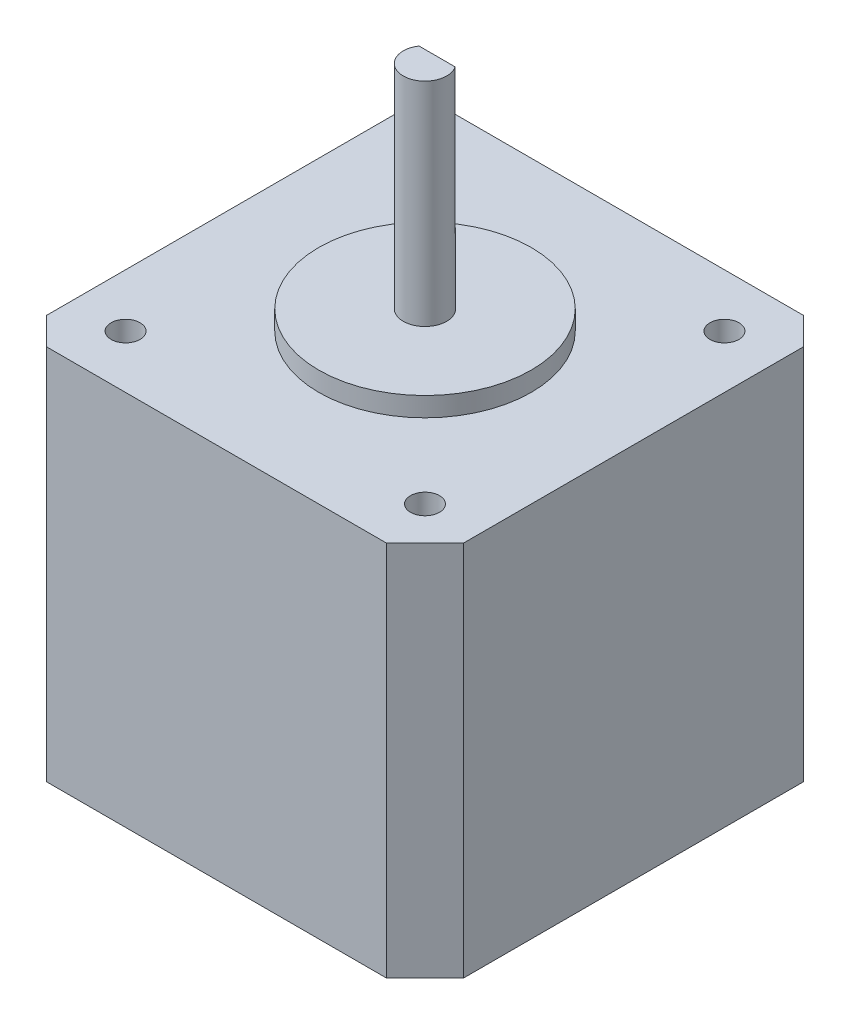
ISO-10303-21;
HEADER;
FILE_DESCRIPTION(('STEP AP214'),'2;1');
FILE_NAME('part.step','',(''),(''),'','','');
FILE_SCHEMA(('AUTOMOTIVE_DESIGN { 1 0 10303 214 1 1 1 1 }'));
ENDSEC;
DATA;
#1=APPLICATION_CONTEXT('core data for automotive mechanical design processes');
#2=APPLICATION_PROTOCOL_DEFINITION('international standard','automotive_design',2000,#1);
#3=PRODUCT_CONTEXT('',#1,'mechanical');
#4=PRODUCT('Part','Part','',(#3));
#5=PRODUCT_RELATED_PRODUCT_CATEGORY('part','',(#4));
#6=PRODUCT_DEFINITION_FORMATION('','',#4);
#7=PRODUCT_DEFINITION_CONTEXT('part definition',#1,'design');
#8=PRODUCT_DEFINITION('design','',#6,#7);
#9=PRODUCT_DEFINITION_SHAPE('','',#8);
#10=(LENGTH_UNIT() NAMED_UNIT(*) SI_UNIT(.MILLI.,.METRE.));
#11=(NAMED_UNIT(*) PLANE_ANGLE_UNIT() SI_UNIT($,.RADIAN.));
#12=(NAMED_UNIT(*) SI_UNIT($,.STERADIAN.) SOLID_ANGLE_UNIT());
#13=UNCERTAINTY_MEASURE_WITH_UNIT(LENGTH_MEASURE(1.E-05),#10,'distance_accuracy_value','');
#14=(GEOMETRIC_REPRESENTATION_CONTEXT(3) GLOBAL_UNCERTAINTY_ASSIGNED_CONTEXT((#13)) GLOBAL_UNIT_ASSIGNED_CONTEXT((#10,
#11,#12)) REPRESENTATION_CONTEXT('',''));
#15=CARTESIAN_POINT('',(0.,0.,0.));
#16=DIRECTION('',(0.,0.,1.));
#17=DIRECTION('',(1.,0.,0.));
#18=AXIS2_PLACEMENT_3D('',#15,#16,#17);
#19=CARTESIAN_POINT('',(-21.,39.,-18.1715728752538));
#20=DIRECTION('',(1.,0.,0.));
#21=DIRECTION('',(0.,0.,-1.));
#22=AXIS2_PLACEMENT_3D('',#19,#20,#21);
#23=PLANE('',#22);
#24=DIRECTION('',(0.,0.,1.));
#25=VECTOR('',#24,1.);
#26=CARTESIAN_POINT('',(-21.,0.,-18.1715728752538));
#27=LINE('',#26,#25);
#28=CARTESIAN_POINT('',(-21.,0.,-18.1715728752538));
#29=VERTEX_POINT('',#28);
#30=CARTESIAN_POINT('',(-21.,0.,18.1715728752538));
#31=VERTEX_POINT('',#30);
#32=EDGE_CURVE('E151',#29,#31,#27,.T.);
#33=ORIENTED_EDGE('',*,*,#32,.T.);
#34=DIRECTION('',(0.,-1.,0.));
#35=VECTOR('',#34,1.);
#36=CARTESIAN_POINT('',(-21.,39.,18.1715728752538));
#37=LINE('',#36,#35);
#38=CARTESIAN_POINT('',(-21.,39.,18.1715728752538));
#39=VERTEX_POINT('',#38);
#40=EDGE_CURVE('E11',#39,#31,#37,.T.);
#41=ORIENTED_EDGE('',*,*,#40,.F.);
#42=DIRECTION('',(0.,0.,1.));
#43=VECTOR('',#42,1.);
#44=CARTESIAN_POINT('',(-21.,39.,-18.1715728752538));
#45=LINE('',#44,#43);
#46=CARTESIAN_POINT('',(-21.,39.,-18.1715728752538));
#47=VERTEX_POINT('',#46);
#48=EDGE_CURVE('E170',#47,#39,#45,.T.);
#49=ORIENTED_EDGE('',*,*,#48,.F.);
#50=DIRECTION('',(0.,-1.,0.));
#51=VECTOR('',#50,1.);
#52=CARTESIAN_POINT('',(-21.,39.,-18.1715728752538));
#53=LINE('',#52,#51);
#54=EDGE_CURVE('E150',#47,#29,#53,.T.);
#55=ORIENTED_EDGE('',*,*,#54,.T.);
#56=EDGE_LOOP('',(#33,#41,#49,#55));
#57=FACE_BOUND('',#56,.T.);
#58=ADVANCED_FACE('F43',(#57),#23,.F.);
#59=CARTESIAN_POINT('',(-18.1715728752538,39.,21.));
#60=DIRECTION('',(0.707106781186543,0.,-0.707106781186552));
#61=DIRECTION('',(-0.707106781186552,0.,-0.707106781186543));
#62=AXIS2_PLACEMENT_3D('',#59,#60,#61);
#63=PLANE('',#62);
#64=DIRECTION('',(0.707106781186552,0.,0.707106781186543));
#65=VECTOR('',#64,1.);
#66=CARTESIAN_POINT('',(-18.1715728752538,0.,21.));
#67=LINE('',#66,#65);
#68=CARTESIAN_POINT('',(-18.1715728752538,0.,21.));
#69=VERTEX_POINT('',#68);
#70=EDGE_CURVE('E152',#31,#69,#67,.T.);
#71=ORIENTED_EDGE('',*,*,#70,.T.);
#72=DIRECTION('',(0.,-1.,0.));
#73=VECTOR('',#72,1.);
#74=CARTESIAN_POINT('',(-18.1715728752538,39.,21.));
#75=LINE('',#74,#73);
#76=CARTESIAN_POINT('',(-18.1715728752538,39.,21.));
#77=VERTEX_POINT('',#76);
#78=EDGE_CURVE('E51',#77,#69,#75,.T.);
#79=ORIENTED_EDGE('',*,*,#78,.F.);
#80=DIRECTION('',(0.707106781186552,0.,0.707106781186543));
#81=VECTOR('',#80,1.);
#82=CARTESIAN_POINT('',(-18.1715728752538,39.,21.));
#83=LINE('',#82,#81);
#84=EDGE_CURVE('E110',#39,#77,#83,.T.);
#85=ORIENTED_EDGE('',*,*,#84,.F.);
#86=ORIENTED_EDGE('',*,*,#40,.T.);
#87=EDGE_LOOP('',(#71,#79,#85,#86));
#88=FACE_BOUND('',#87,.T.);
#89=ADVANCED_FACE('F272',(#88),#63,.F.);
#90=CARTESIAN_POINT('',(-18.1715728752538,39.,21.));
#91=DIRECTION('',(0.,0.,-1.));
#92=DIRECTION('',(-1.,0.,0.));
#93=AXIS2_PLACEMENT_3D('',#90,#91,#92);
#94=PLANE('',#93);
#95=DIRECTION('',(1.,0.,0.));
#96=VECTOR('',#95,1.);
#97=CARTESIAN_POINT('',(-18.1715728752538,0.,21.));
#98=LINE('',#97,#96);
#99=CARTESIAN_POINT('',(17.,0.,21.));
#100=VERTEX_POINT('',#99);
#101=EDGE_CURVE('E160',#69,#100,#98,.T.);
#102=ORIENTED_EDGE('',*,*,#101,.T.);
#103=DIRECTION('',(0.,-1.,0.));
#104=VECTOR('',#103,1.);
#105=CARTESIAN_POINT('',(17.,39.,21.));
#106=LINE('',#105,#104);
#107=CARTESIAN_POINT('',(17.,39.,21.));
#108=VERTEX_POINT('',#107);
#109=EDGE_CURVE('E173',#108,#100,#106,.T.);
#110=ORIENTED_EDGE('',*,*,#109,.F.);
#111=DIRECTION('',(1.,0.,0.));
#112=VECTOR('',#111,1.);
#113=CARTESIAN_POINT('',(-18.1715728752538,39.,21.));
#114=LINE('',#113,#112);
#115=EDGE_CURVE('E181',#77,#108,#114,.T.);
#116=ORIENTED_EDGE('',*,*,#115,.F.);
#117=ORIENTED_EDGE('',*,*,#78,.T.);
#118=EDGE_LOOP('',(#102,#110,#116,#117));
#119=FACE_BOUND('',#118,.T.);
#120=ADVANCED_FACE('F182',(#119),#94,.F.);
#121=CARTESIAN_POINT('',(21.,39.,17.));
#122=DIRECTION('',(-0.707106781186544,0.,-0.707106781186551));
#123=DIRECTION('',(-0.707106781186551,0.,0.707106781186544));
#124=AXIS2_PLACEMENT_3D('',#121,#122,#123);
#125=PLANE('',#124);
#126=DIRECTION('',(0.707106781186551,0.,-0.707106781186544));
#127=VECTOR('',#126,1.);
#128=CARTESIAN_POINT('',(21.,0.,17.));
#129=LINE('',#128,#127);
#130=CARTESIAN_POINT('',(21.,0.,17.));
#131=VERTEX_POINT('',#130);
#132=EDGE_CURVE('E157',#100,#131,#129,.T.);
#133=ORIENTED_EDGE('',*,*,#132,.T.);
#134=DIRECTION('',(0.,-1.,0.));
#135=VECTOR('',#134,1.);
#136=CARTESIAN_POINT('',(21.,39.,17.));
#137=LINE('',#136,#135);
#138=CARTESIAN_POINT('',(21.,39.,17.));
#139=VERTEX_POINT('',#138);
#140=EDGE_CURVE('E174',#139,#131,#137,.T.);
#141=ORIENTED_EDGE('',*,*,#140,.F.);
#142=DIRECTION('',(0.707106781186551,0.,-0.707106781186544));
#143=VECTOR('',#142,1.);
#144=CARTESIAN_POINT('',(21.,39.,17.));
#145=LINE('',#144,#143);
#146=EDGE_CURVE('E194',#108,#139,#145,.T.);
#147=ORIENTED_EDGE('',*,*,#146,.F.);
#148=ORIENTED_EDGE('',*,*,#109,.T.);
#149=EDGE_LOOP('',(#133,#141,#147,#148));
#150=FACE_BOUND('',#149,.T.);
#151=ADVANCED_FACE('F191',(#150),#125,.F.);
#152=CARTESIAN_POINT('',(21.,39.,-18.1715728752538));
#153=DIRECTION('',(-1.,0.,0.));
#154=DIRECTION('',(0.,0.,1.));
#155=AXIS2_PLACEMENT_3D('',#152,#153,#154);
#156=PLANE('',#155);
#157=DIRECTION('',(0.,0.,-1.));
#158=VECTOR('',#157,1.);
#159=CARTESIAN_POINT('',(21.,0.,-18.1715728752538));
#160=LINE('',#159,#158);
#161=CARTESIAN_POINT('',(21.,0.,-18.1715728752538));
#162=VERTEX_POINT('',#161);
#163=EDGE_CURVE('E161',#131,#162,#160,.T.);
#164=ORIENTED_EDGE('',*,*,#163,.T.);
#165=DIRECTION('',(0.,-1.,0.));
#166=VECTOR('',#165,1.);
#167=CARTESIAN_POINT('',(21.,39.,-18.1715728752538));
#168=LINE('',#167,#166);
#169=CARTESIAN_POINT('',(21.,39.,-18.1715728752538));
#170=VERTEX_POINT('',#169);
#171=EDGE_CURVE('E142',#170,#162,#168,.T.);
#172=ORIENTED_EDGE('',*,*,#171,.F.);
#173=DIRECTION('',(0.,0.,-1.));
#174=VECTOR('',#173,1.);
#175=CARTESIAN_POINT('',(21.,39.,-18.1715728752538));
#176=LINE('',#175,#174);
#177=EDGE_CURVE('E128',#139,#170,#176,.T.);
#178=ORIENTED_EDGE('',*,*,#177,.F.);
#179=ORIENTED_EDGE('',*,*,#140,.T.);
#180=EDGE_LOOP('',(#164,#172,#178,#179));
#181=FACE_BOUND('',#180,.T.);
#182=ADVANCED_FACE('F193',(#181),#156,.F.);
#183=CARTESIAN_POINT('',(18.1715728752538,39.,-21.));
#184=DIRECTION('',(-0.707106781186549,0.,0.707106781186546));
#185=DIRECTION('',(0.707106781186546,0.,0.707106781186549));
#186=AXIS2_PLACEMENT_3D('',#183,#184,#185);
#187=PLANE('',#186);
#188=DIRECTION('',(-0.707106781186546,0.,-0.707106781186549));
#189=VECTOR('',#188,1.);
#190=CARTESIAN_POINT('',(18.1715728752538,0.,-21.));
#191=LINE('',#190,#189);
#192=CARTESIAN_POINT('',(18.1715728752538,0.,-21.));
#193=VERTEX_POINT('',#192);
#194=EDGE_CURVE('E138',#162,#193,#191,.T.);
#195=ORIENTED_EDGE('',*,*,#194,.T.);
#196=DIRECTION('',(0.,-1.,0.));
#197=VECTOR('',#196,1.);
#198=CARTESIAN_POINT('',(18.1715728752538,39.,-21.));
#199=LINE('',#198,#197);
#200=CARTESIAN_POINT('',(18.1715728752538,39.,-21.));
#201=VERTEX_POINT('',#200);
#202=EDGE_CURVE('E136',#201,#193,#199,.T.);
#203=ORIENTED_EDGE('',*,*,#202,.F.);
#204=DIRECTION('',(-0.707106781186546,0.,-0.707106781186549));
#205=VECTOR('',#204,1.);
#206=CARTESIAN_POINT('',(18.1715728752538,39.,-21.));
#207=LINE('',#206,#205);
#208=EDGE_CURVE('E122',#170,#201,#207,.T.);
#209=ORIENTED_EDGE('',*,*,#208,.F.);
#210=ORIENTED_EDGE('',*,*,#171,.T.);
#211=EDGE_LOOP('',(#195,#203,#209,#210));
#212=FACE_BOUND('',#211,.T.);
#213=ADVANCED_FACE('F140',(#212),#187,.F.);
#214=CARTESIAN_POINT('',(-18.1715728752538,39.,-21.));
#215=DIRECTION('',(0.,0.,1.));
#216=DIRECTION('',(1.,0.,0.));
#217=AXIS2_PLACEMENT_3D('',#214,#215,#216);
#218=PLANE('',#217);
#219=DIRECTION('',(-1.,0.,0.));
#220=VECTOR('',#219,1.);
#221=CARTESIAN_POINT('',(-18.1715728752538,0.,-21.));
#222=LINE('',#221,#220);
#223=CARTESIAN_POINT('',(-18.1715728752538,0.,-21.));
#224=VERTEX_POINT('',#223);
#225=EDGE_CURVE('E163',#193,#224,#222,.T.);
#226=ORIENTED_EDGE('',*,*,#225,.T.);
#227=DIRECTION('',(0.,-1.,0.));
#228=VECTOR('',#227,1.);
#229=CARTESIAN_POINT('',(-18.1715728752538,39.,-21.));
#230=LINE('',#229,#228);
#231=CARTESIAN_POINT('',(-18.1715728752538,39.,-21.));
#232=VERTEX_POINT('',#231);
#233=EDGE_CURVE('E141',#232,#224,#230,.T.);
#234=ORIENTED_EDGE('',*,*,#233,.F.);
#235=DIRECTION('',(-1.,0.,0.));
#236=VECTOR('',#235,1.);
#237=CARTESIAN_POINT('',(-18.1715728752538,39.,-21.));
#238=LINE('',#237,#236);
#239=EDGE_CURVE('E130',#201,#232,#238,.T.);
#240=ORIENTED_EDGE('',*,*,#239,.F.);
#241=ORIENTED_EDGE('',*,*,#202,.T.);
#242=EDGE_LOOP('',(#226,#234,#240,#241));
#243=FACE_BOUND('',#242,.T.);
#244=ADVANCED_FACE('F144',(#243),#218,.F.);
#245=CARTESIAN_POINT('',(-21.,39.,-18.1715728752538));
#246=DIRECTION('',(0.707106781186552,0.,0.707106781186543));
#247=DIRECTION('',(0.707106781186543,0.,-0.707106781186552));
#248=AXIS2_PLACEMENT_3D('',#245,#246,#247);
#249=PLANE('',#248);
#250=DIRECTION('',(-0.707106781186543,0.,0.707106781186552));
#251=VECTOR('',#250,1.);
#252=CARTESIAN_POINT('',(-21.,0.,-18.1715728752538));
#253=LINE('',#252,#251);
#254=EDGE_CURVE('E97',#224,#29,#253,.T.);
#255=ORIENTED_EDGE('',*,*,#254,.T.);
#256=ORIENTED_EDGE('',*,*,#54,.F.);
#257=DIRECTION('',(-0.707106781186543,0.,0.707106781186552));
#258=VECTOR('',#257,1.);
#259=CARTESIAN_POINT('',(-21.,39.,-18.1715728752538));
#260=LINE('',#259,#258);
#261=EDGE_CURVE('E66',#232,#47,#260,.T.);
#262=ORIENTED_EDGE('',*,*,#261,.F.);
#263=ORIENTED_EDGE('',*,*,#233,.T.);
#264=EDGE_LOOP('',(#255,#256,#262,#263));
#265=FACE_BOUND('',#264,.T.);
#266=ADVANCED_FACE('F278',(#265),#249,.F.);
#267=CARTESIAN_POINT('',(0.,39.,0.));
#268=DIRECTION('',(0.,1.,0.));
#269=DIRECTION('',(0.,0.,1.));
#270=AXIS2_PLACEMENT_3D('',#267,#268,#269);
#271=PLANE('',#270);
#272=CARTESIAN_POINT('',(-15.5,39.,15.5));
#273=DIRECTION('',(0.,-1.,0.));
#274=DIRECTION('',(0.,0.,-1.));
#275=AXIS2_PLACEMENT_3D('',#272,#273,#274);
#276=CIRCLE('',#275,1.5);
#277=CARTESIAN_POINT('',(-15.5,39.,14.));
#278=VERTEX_POINT('',#277);
#279=EDGE_CURVE('E228',#278,#278,#276,.T.);
#280=ORIENTED_EDGE('',*,*,#279,.T.);
#281=EDGE_LOOP('',(#280));
#282=FACE_BOUND('',#281,.T.);
#283=CARTESIAN_POINT('',(15.5,39.,15.5));
#284=DIRECTION('',(0.,-1.,0.));
#285=DIRECTION('',(0.,0.,-1.));
#286=AXIS2_PLACEMENT_3D('',#283,#284,#285);
#287=CIRCLE('',#286,1.5);
#288=CARTESIAN_POINT('',(15.5,39.,14.));
#289=VERTEX_POINT('',#288);
#290=EDGE_CURVE('E225',#289,#289,#287,.T.);
#291=ORIENTED_EDGE('',*,*,#290,.T.);
#292=EDGE_LOOP('',(#291));
#293=FACE_BOUND('',#292,.T.);
#294=CARTESIAN_POINT('',(-15.5,39.,-15.5));
#295=DIRECTION('',(0.,1.,0.));
#296=DIRECTION('',(0.,0.,1.));
#297=AXIS2_PLACEMENT_3D('',#294,#295,#296);
#298=CIRCLE('',#297,1.5);
#299=CARTESIAN_POINT('',(-15.5,39.,-14.));
#300=VERTEX_POINT('',#299);
#301=EDGE_CURVE('E220',#300,#300,#298,.T.);
#302=ORIENTED_EDGE('',*,*,#301,.F.);
#303=EDGE_LOOP('',(#302));
#304=FACE_BOUND('',#303,.T.);
#305=CARTESIAN_POINT('',(15.5,39.,-15.5));
#306=DIRECTION('',(0.,1.,0.));
#307=DIRECTION('',(0.,0.,1.));
#308=AXIS2_PLACEMENT_3D('',#305,#306,#307);
#309=CIRCLE('',#308,1.5);
#310=CARTESIAN_POINT('',(15.5,39.,-14.));
#311=VERTEX_POINT('',#310);
#312=EDGE_CURVE('E213',#311,#311,#309,.T.);
#313=ORIENTED_EDGE('',*,*,#312,.F.);
#314=EDGE_LOOP('',(#313));
#315=FACE_BOUND('',#314,.T.);
#316=CARTESIAN_POINT('',(0.,39.,0.));
#317=DIRECTION('',(0.,1.,0.));
#318=DIRECTION('',(0.,0.,1.));
#319=AXIS2_PLACEMENT_3D('',#316,#317,#318);
#320=CIRCLE('',#319,11.);
#321=CARTESIAN_POINT('',(0.,39.,11.));
#322=VERTEX_POINT('',#321);
#323=EDGE_CURVE('E201',#322,#322,#320,.T.);
#324=ORIENTED_EDGE('',*,*,#323,.F.);
#325=EDGE_LOOP('',(#324));
#326=FACE_BOUND('',#325,.T.);
#327=ORIENTED_EDGE('',*,*,#48,.T.);
#328=ORIENTED_EDGE('',*,*,#84,.T.);
#329=ORIENTED_EDGE('',*,*,#115,.T.);
#330=ORIENTED_EDGE('',*,*,#146,.T.);
#331=ORIENTED_EDGE('',*,*,#177,.T.);
#332=ORIENTED_EDGE('',*,*,#208,.T.);
#333=ORIENTED_EDGE('',*,*,#239,.T.);
#334=ORIENTED_EDGE('',*,*,#261,.T.);
#335=EDGE_LOOP('',(#327,#328,#329,#330,#331,#332,#333,#334));
#336=FACE_BOUND('',#335,.T.);
#337=ADVANCED_FACE('F124',(#282,#293,#304,#315,#326,#336),#271,.T.);
#338=CARTESIAN_POINT('',(0.,0.,0.));
#339=DIRECTION('',(0.,1.,0.));
#340=DIRECTION('',(0.,0.,1.));
#341=AXIS2_PLACEMENT_3D('',#338,#339,#340);
#342=PLANE('',#341);
#343=ORIENTED_EDGE('',*,*,#32,.F.);
#344=ORIENTED_EDGE('',*,*,#254,.F.);
#345=ORIENTED_EDGE('',*,*,#225,.F.);
#346=ORIENTED_EDGE('',*,*,#194,.F.);
#347=ORIENTED_EDGE('',*,*,#163,.F.);
#348=ORIENTED_EDGE('',*,*,#132,.F.);
#349=ORIENTED_EDGE('',*,*,#101,.F.);
#350=ORIENTED_EDGE('',*,*,#70,.F.);
#351=EDGE_LOOP('',(#343,#344,#345,#346,#347,#348,#349,#350));
#352=FACE_BOUND('',#351,.T.);
#353=ADVANCED_FACE('F186',(#352),#342,.F.);
#354=CARTESIAN_POINT('',(0.,41.,0.));
#355=DIRECTION('',(0.,-1.,0.));
#356=DIRECTION('',(0.,0.,-1.));
#357=AXIS2_PLACEMENT_3D('',#354,#355,#356);
#358=CYLINDRICAL_SURFACE('',#357,11.);
#359=CARTESIAN_POINT('',(0.,41.,0.));
#360=DIRECTION('',(0.,1.,0.));
#361=DIRECTION('',(0.,0.,1.));
#362=AXIS2_PLACEMENT_3D('',#359,#360,#361);
#363=CIRCLE('',#362,11.);
#364=CARTESIAN_POINT('',(0.,41.,11.));
#365=VERTEX_POINT('',#364);
#366=EDGE_CURVE('E206',#365,#365,#363,.T.);
#367=ORIENTED_EDGE('',*,*,#366,.F.);
#368=EDGE_LOOP('',(#367));
#369=FACE_BOUND('',#368,.T.);
#370=ORIENTED_EDGE('',*,*,#323,.T.);
#371=EDGE_LOOP('',(#370));
#372=FACE_BOUND('',#371,.T.);
#373=ADVANCED_FACE('F268',(#369,#372),#358,.T.);
#374=CARTESIAN_POINT('',(0.,41.,0.));
#375=DIRECTION('',(0.,1.,0.));
#376=DIRECTION('',(0.,0.,1.));
#377=AXIS2_PLACEMENT_3D('',#374,#375,#376);
#378=PLANE('',#377);
#379=CARTESIAN_POINT('',(0.,41.,0.));
#380=DIRECTION('',(0.,1.,0.));
#381=DIRECTION('',(0.,0.,1.));
#382=AXIS2_PLACEMENT_3D('',#379,#380,#381);
#383=CIRCLE('',#382,2.25);
#384=CARTESIAN_POINT('',(0.,41.,2.25));
#385=VERTEX_POINT('',#384);
#386=EDGE_CURVE('E46',#385,#385,#383,.T.);
#387=ORIENTED_EDGE('',*,*,#386,.F.);
#388=EDGE_LOOP('',(#387));
#389=FACE_BOUND('',#388,.T.);
#390=ORIENTED_EDGE('',*,*,#366,.T.);
#391=EDGE_LOOP('',(#390));
#392=FACE_BOUND('',#391,.T.);
#393=ADVANCED_FACE('F259',(#389,#392),#378,.T.);
#394=CARTESIAN_POINT('',(0.,63.,0.));
#395=DIRECTION('',(0.,1.,0.));
#396=DIRECTION('',(0.,0.,1.));
#397=AXIS2_PLACEMENT_3D('',#394,#395,#396);
#398=PLANE('',#397);
#399=DIRECTION('',(1.,0.,0.));
#400=VECTOR('',#399,1.);
#401=CARTESIAN_POINT('',(1.87082869338697,63.,-1.25));
#402=LINE('',#401,#400);
#403=CARTESIAN_POINT('',(-1.87082869338697,63.,-1.25));
#404=VERTEX_POINT('',#403);
#405=CARTESIAN_POINT('',(1.87082869338697,63.,-1.25));
#406=VERTEX_POINT('',#405);
#407=EDGE_CURVE('E239',#404,#406,#402,.T.);
#408=ORIENTED_EDGE('',*,*,#407,.F.);
#409=CARTESIAN_POINT('',(0.,63.,0.));
#410=DIRECTION('',(0.,1.,0.));
#411=DIRECTION('',(0.,0.,1.));
#412=AXIS2_PLACEMENT_3D('',#409,#410,#411);
#413=CIRCLE('',#412,2.25);
#414=EDGE_CURVE('E154',#404,#406,#413,.T.);
#415=ORIENTED_EDGE('',*,*,#414,.T.);
#416=EDGE_LOOP('',(#408,#415));
#417=FACE_BOUND('',#416,.T.);
#418=ADVANCED_FACE('F260',(#417),#398,.T.);
#419=CARTESIAN_POINT('',(0.,63.,0.));
#420=DIRECTION('',(0.,-1.,0.));
#421=DIRECTION('',(0.,0.,-1.));
#422=AXIS2_PLACEMENT_3D('',#419,#420,#421);
#423=CYLINDRICAL_SURFACE('',#422,2.25);
#424=CARTESIAN_POINT('',(0.,48.,0.));
#425=DIRECTION('',(0.,1.,0.));
#426=DIRECTION('',(0.,0.,-1.));
#427=AXIS2_PLACEMENT_3D('',#424,#425,#426);
#428=CIRCLE('',#427,2.25);
#429=CARTESIAN_POINT('',(1.87082869338697,48.,-1.25));
#430=VERTEX_POINT('',#429);
#431=CARTESIAN_POINT('',(-1.87082869338697,48.,-1.25));
#432=VERTEX_POINT('',#431);
#433=EDGE_CURVE('E241',#430,#432,#428,.T.);
#434=ORIENTED_EDGE('',*,*,#433,.F.);
#435=DIRECTION('',(0.,1.,0.));
#436=VECTOR('',#435,1.);
#437=CARTESIAN_POINT('',(1.87082869338697,48.,-1.25));
#438=LINE('',#437,#436);
#439=EDGE_CURVE('E229',#430,#406,#438,.T.);
#440=ORIENTED_EDGE('',*,*,#439,.T.);
#441=ORIENTED_EDGE('',*,*,#414,.F.);
#442=DIRECTION('',(0.,1.,0.));
#443=VECTOR('',#442,1.);
#444=CARTESIAN_POINT('',(-1.87082869338697,48.,-1.25));
#445=LINE('',#444,#443);
#446=EDGE_CURVE('E233',#432,#404,#445,.T.);
#447=ORIENTED_EDGE('',*,*,#446,.F.);
#448=EDGE_LOOP('',(#434,#440,#441,#447));
#449=FACE_BOUND('',#448,.T.);
#450=ORIENTED_EDGE('',*,*,#386,.T.);
#451=EDGE_LOOP('',(#450));
#452=FACE_BOUND('',#451,.T.);
#453=ADVANCED_FACE('F255',(#449,#452),#423,.T.);
#454=CARTESIAN_POINT('',(15.5,34.5,-15.5));
#455=DIRECTION('',(0.,1.,0.));
#456=DIRECTION('',(0.,0.,1.));
#457=AXIS2_PLACEMENT_3D('',#454,#455,#456);
#458=CYLINDRICAL_SURFACE('',#457,1.5);
#459=CARTESIAN_POINT('',(15.5,34.5,-15.5));
#460=DIRECTION('',(0.,1.,0.));
#461=DIRECTION('',(0.,0.,1.));
#462=AXIS2_PLACEMENT_3D('',#459,#460,#461);
#463=CIRCLE('',#462,1.5);
#464=CARTESIAN_POINT('',(15.5,34.5,-14.));
#465=VERTEX_POINT('',#464);
#466=EDGE_CURVE('E209',#465,#465,#463,.T.);
#467=ORIENTED_EDGE('',*,*,#466,.F.);
#468=EDGE_LOOP('',(#467));
#469=FACE_BOUND('',#468,.T.);
#470=ORIENTED_EDGE('',*,*,#312,.T.);
#471=EDGE_LOOP('',(#470));
#472=FACE_BOUND('',#471,.T.);
#473=ADVANCED_FACE('F264',(#469,#472),#458,.F.);
#474=CARTESIAN_POINT('',(15.5,34.5,-15.5));
#475=DIRECTION('',(0.,1.,0.));
#476=DIRECTION('',(0.,0.,1.));
#477=AXIS2_PLACEMENT_3D('',#474,#475,#476);
#478=PLANE('',#477);
#479=ORIENTED_EDGE('',*,*,#466,.T.);
#480=EDGE_LOOP('',(#479));
#481=FACE_BOUND('',#480,.T.);
#482=ADVANCED_FACE('F361',(#481),#478,.T.);
#483=CARTESIAN_POINT('',(-15.5,34.5,-15.5));
#484=DIRECTION('',(0.,1.,0.));
#485=DIRECTION('',(0.,0.,1.));
#486=AXIS2_PLACEMENT_3D('',#483,#484,#485);
#487=CYLINDRICAL_SURFACE('',#486,1.5);
#488=CARTESIAN_POINT('',(-15.5,34.5,-15.5));
#489=DIRECTION('',(0.,1.,0.));
#490=DIRECTION('',(0.,0.,1.));
#491=AXIS2_PLACEMENT_3D('',#488,#489,#490);
#492=CIRCLE('',#491,1.5);
#493=CARTESIAN_POINT('',(-15.5,34.5,-14.));
#494=VERTEX_POINT('',#493);
#495=EDGE_CURVE('E210',#494,#494,#492,.T.);
#496=ORIENTED_EDGE('',*,*,#495,.F.);
#497=EDGE_LOOP('',(#496));
#498=FACE_BOUND('',#497,.T.);
#499=ORIENTED_EDGE('',*,*,#301,.T.);
#500=EDGE_LOOP('',(#499));
#501=FACE_BOUND('',#500,.T.);
#502=ADVANCED_FACE('F375',(#498,#501),#487,.F.);
#503=CARTESIAN_POINT('',(-15.5,34.5,-15.5));
#504=DIRECTION('',(0.,1.,0.));
#505=DIRECTION('',(0.,0.,1.));
#506=AXIS2_PLACEMENT_3D('',#503,#504,#505);
#507=PLANE('',#506);
#508=ORIENTED_EDGE('',*,*,#495,.T.);
#509=EDGE_LOOP('',(#508));
#510=FACE_BOUND('',#509,.T.);
#511=ADVANCED_FACE('F379',(#510),#507,.T.);
#512=CARTESIAN_POINT('',(15.5,34.5,15.5));
#513=DIRECTION('',(0.,1.,0.));
#514=DIRECTION('',(0.,0.,1.));
#515=AXIS2_PLACEMENT_3D('',#512,#513,#514);
#516=CYLINDRICAL_SURFACE('',#515,1.5);
#517=CARTESIAN_POINT('',(15.5,34.5,15.5));
#518=DIRECTION('',(0.,-1.,0.));
#519=DIRECTION('',(0.,0.,-1.));
#520=AXIS2_PLACEMENT_3D('',#517,#518,#519);
#521=CIRCLE('',#520,1.5);
#522=CARTESIAN_POINT('',(15.5,34.5,14.));
#523=VERTEX_POINT('',#522);
#524=EDGE_CURVE('E223',#523,#523,#521,.T.);
#525=ORIENTED_EDGE('',*,*,#524,.T.);
#526=EDGE_LOOP('',(#525));
#527=FACE_BOUND('',#526,.T.);
#528=ORIENTED_EDGE('',*,*,#290,.F.);
#529=EDGE_LOOP('',(#528));
#530=FACE_BOUND('',#529,.T.);
#531=ADVANCED_FACE('F389',(#527,#530),#516,.F.);
#532=CARTESIAN_POINT('',(15.5,34.5,15.5));
#533=DIRECTION('',(0.,1.,0.));
#534=DIRECTION('',(0.,0.,-1.));
#535=AXIS2_PLACEMENT_3D('',#532,#533,#534);
#536=PLANE('',#535);
#537=ORIENTED_EDGE('',*,*,#524,.F.);
#538=EDGE_LOOP('',(#537));
#539=FACE_BOUND('',#538,.T.);
#540=ADVANCED_FACE('F399',(#539),#536,.T.);
#541=CARTESIAN_POINT('',(-15.5,34.5,15.5));
#542=DIRECTION('',(0.,1.,0.));
#543=DIRECTION('',(0.,0.,1.));
#544=AXIS2_PLACEMENT_3D('',#541,#542,#543);
#545=CYLINDRICAL_SURFACE('',#544,1.5);
#546=CARTESIAN_POINT('',(-15.5,34.5,15.5));
#547=DIRECTION('',(0.,-1.,0.));
#548=DIRECTION('',(0.,0.,-1.));
#549=AXIS2_PLACEMENT_3D('',#546,#547,#548);
#550=CIRCLE('',#549,1.5);
#551=CARTESIAN_POINT('',(-15.5,34.5,14.));
#552=VERTEX_POINT('',#551);
#553=EDGE_CURVE('E212',#552,#552,#550,.T.);
#554=ORIENTED_EDGE('',*,*,#553,.T.);
#555=EDGE_LOOP('',(#554));
#556=FACE_BOUND('',#555,.T.);
#557=ORIENTED_EDGE('',*,*,#279,.F.);
#558=EDGE_LOOP('',(#557));
#559=FACE_BOUND('',#558,.T.);
#560=ADVANCED_FACE('F407',(#556,#559),#545,.F.);
#561=CARTESIAN_POINT('',(-15.5,34.5,15.5));
#562=DIRECTION('',(0.,1.,0.));
#563=DIRECTION('',(0.,0.,-1.));
#564=AXIS2_PLACEMENT_3D('',#561,#562,#563);
#565=PLANE('',#564);
#566=ORIENTED_EDGE('',*,*,#553,.F.);
#567=EDGE_LOOP('',(#566));
#568=FACE_BOUND('',#567,.T.);
#569=ADVANCED_FACE('F419',(#568),#565,.T.);
#570=CARTESIAN_POINT('',(1.87082869338697,48.,-1.25));
#571=DIRECTION('',(0.,0.,1.));
#572=DIRECTION('',(1.,0.,0.));
#573=AXIS2_PLACEMENT_3D('',#570,#571,#572);
#574=PLANE('',#573);
#575=ORIENTED_EDGE('',*,*,#407,.T.);
#576=ORIENTED_EDGE('',*,*,#439,.F.);
#577=DIRECTION('',(1.,0.,0.));
#578=VECTOR('',#577,1.);
#579=CARTESIAN_POINT('',(1.87082869338697,48.,-1.25));
#580=LINE('',#579,#578);
#581=EDGE_CURVE('E60',#432,#430,#580,.T.);
#582=ORIENTED_EDGE('',*,*,#581,.F.);
#583=ORIENTED_EDGE('',*,*,#446,.T.);
#584=EDGE_LOOP('',(#575,#576,#582,#583));
#585=FACE_BOUND('',#584,.T.);
#586=ADVANCED_FACE('F249',(#585),#574,.F.);
#587=CARTESIAN_POINT('',(0.,48.,0.));
#588=DIRECTION('',(0.,-1.,0.));
#589=DIRECTION('',(0.,0.,-1.));
#590=AXIS2_PLACEMENT_3D('',#587,#588,#589);
#591=PLANE('',#590);
#592=ORIENTED_EDGE('',*,*,#433,.T.);
#593=ORIENTED_EDGE('',*,*,#581,.T.);
#594=EDGE_LOOP('',(#592,#593));
#595=FACE_BOUND('',#594,.T.);
#596=ADVANCED_FACE('F242',(#595),#591,.F.);
#597=CLOSED_SHELL('',(#58,#89,#120,#151,#182,#213,#244,#266,#337,#353,#373,#393,#418,#453,#473,
#482,#502,#511,#531,#540,#560,#569,#586,#596));
#598=MANIFOLD_SOLID_BREP('B2',#597);
#599=ADVANCED_BREP_SHAPE_REPRESENTATION('',(#18,#598),#14);
#600=SHAPE_DEFINITION_REPRESENTATION(#9,#599);
ENDSEC;
END-ISO-10303-21;
